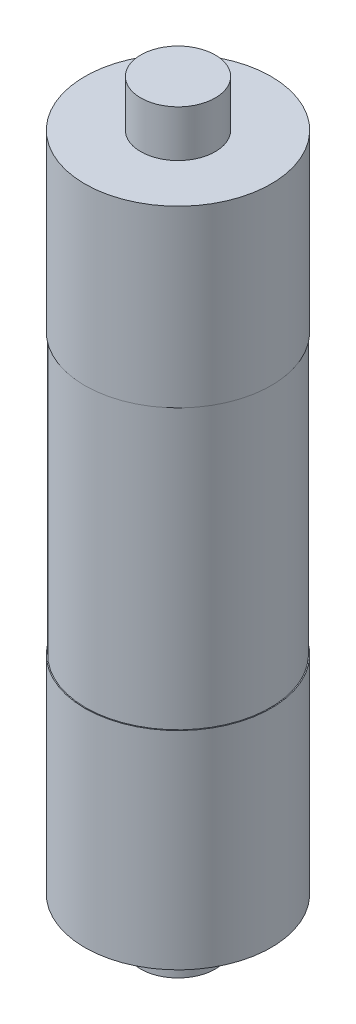
ISO-10303-21;
HEADER;
FILE_DESCRIPTION(('STEP AP214'),'2;1');
FILE_NAME('part.step','',(''),(''),'','','');
FILE_SCHEMA(('AUTOMOTIVE_DESIGN { 1 0 10303 214 1 1 1 1 }'));
ENDSEC;
DATA;
#1=APPLICATION_CONTEXT('core data for automotive mechanical design processes');
#2=APPLICATION_PROTOCOL_DEFINITION('international standard','automotive_design',2000,#1);
#3=PRODUCT_CONTEXT('',#1,'mechanical');
#4=PRODUCT('Part','Part','',(#3));
#5=PRODUCT_RELATED_PRODUCT_CATEGORY('part','',(#4));
#6=PRODUCT_DEFINITION_FORMATION('','',#4);
#7=PRODUCT_DEFINITION_CONTEXT('part definition',#1,'design');
#8=PRODUCT_DEFINITION('design','',#6,#7);
#9=PRODUCT_DEFINITION_SHAPE('','',#8);
#10=(LENGTH_UNIT() NAMED_UNIT(*) SI_UNIT(.MILLI.,.METRE.));
#11=(NAMED_UNIT(*) PLANE_ANGLE_UNIT() SI_UNIT($,.RADIAN.));
#12=(NAMED_UNIT(*) SI_UNIT($,.STERADIAN.) SOLID_ANGLE_UNIT());
#13=UNCERTAINTY_MEASURE_WITH_UNIT(LENGTH_MEASURE(1.E-05),#10,'distance_accuracy_value','');
#14=(GEOMETRIC_REPRESENTATION_CONTEXT(3) GLOBAL_UNCERTAINTY_ASSIGNED_CONTEXT((#13)) GLOBAL_UNIT_ASSIGNED_CONTEXT((#10,
#11,#12)) REPRESENTATION_CONTEXT('',''));
#15=CARTESIAN_POINT('',(0.,0.,0.));
#16=DIRECTION('',(0.,0.,1.));
#17=DIRECTION('',(1.,0.,0.));
#18=AXIS2_PLACEMENT_3D('',#15,#16,#17);
#19=CARTESIAN_POINT('',(0.,71.,0.));
#20=DIRECTION('',(0.,-1.,0.));
#21=DIRECTION('',(0.,0.,-1.));
#22=AXIS2_PLACEMENT_3D('',#19,#20,#21);
#23=CYLINDRICAL_SURFACE('',#22,10.);
#24=CARTESIAN_POINT('',(0.,71.,0.));
#25=DIRECTION('',(0.,1.,0.));
#26=DIRECTION('',(0.,0.,1.));
#27=AXIS2_PLACEMENT_3D('',#24,#25,#26);
#28=CIRCLE('',#27,10.);
#29=CARTESIAN_POINT('',(0.,71.,10.));
#30=VERTEX_POINT('',#29);
#31=EDGE_CURVE('E36',#30,#30,#28,.T.);
#32=ORIENTED_EDGE('',*,*,#31,.F.);
#33=EDGE_LOOP('',(#32));
#34=FACE_BOUND('',#33,.T.);
#35=CARTESIAN_POINT('',(0.,52.25,0.));
#36=DIRECTION('',(0.,1.,0.));
#37=DIRECTION('',(0.,0.,1.));
#38=AXIS2_PLACEMENT_3D('',#35,#36,#37);
#39=CIRCLE('',#38,9.99999999999998);
#40=CARTESIAN_POINT('',(0.,52.25,9.99999999999998));
#41=VERTEX_POINT('',#40);
#42=EDGE_CURVE('E45',#41,#41,#39,.T.);
#43=ORIENTED_EDGE('',*,*,#42,.T.);
#44=EDGE_LOOP('',(#43));
#45=FACE_BOUND('',#44,.T.);
#46=ADVANCED_FACE('F30',(#34,#45),#23,.T.);
#47=CARTESIAN_POINT('',(0.,71.,0.));
#48=DIRECTION('',(0.,1.,0.));
#49=DIRECTION('',(0.,0.,1.));
#50=AXIS2_PLACEMENT_3D('',#47,#48,#49);
#51=PLANE('',#50);
#52=CARTESIAN_POINT('',(0.,71.,0.));
#53=DIRECTION('',(0.,1.,0.));
#54=DIRECTION('',(0.,0.,1.));
#55=AXIS2_PLACEMENT_3D('',#52,#53,#54);
#56=CIRCLE('',#55,4.);
#57=CARTESIAN_POINT('',(0.,71.,4.));
#58=VERTEX_POINT('',#57);
#59=EDGE_CURVE('E62',#58,#58,#56,.T.);
#60=ORIENTED_EDGE('',*,*,#59,.F.);
#61=EDGE_LOOP('',(#60));
#62=FACE_BOUND('',#61,.T.);
#63=ORIENTED_EDGE('',*,*,#31,.T.);
#64=EDGE_LOOP('',(#63));
#65=FACE_BOUND('',#64,.T.);
#66=ADVANCED_FACE('F77',(#62,#65),#51,.T.);
#67=CARTESIAN_POINT('',(0.,52.25,-9.99999999999998));
#68=DIRECTION('',(0.,-1.,0.));
#69=DIRECTION('',(0.,0.,-1.));
#70=AXIS2_PLACEMENT_3D('',#67,#68,#69);
#71=PLANE('',#70);
#72=CARTESIAN_POINT('',(0.,52.25,0.));
#73=DIRECTION('',(0.,1.,0.));
#74=DIRECTION('',(0.,0.,1.));
#75=AXIS2_PLACEMENT_3D('',#72,#73,#74);
#76=CIRCLE('',#75,9.9);
#77=CARTESIAN_POINT('',(0.,52.25,9.9));
#78=VERTEX_POINT('',#77);
#79=EDGE_CURVE('E49',#78,#78,#76,.T.);
#80=ORIENTED_EDGE('',*,*,#79,.T.);
#81=EDGE_LOOP('',(#80));
#82=FACE_BOUND('',#81,.T.);
#83=ORIENTED_EDGE('',*,*,#42,.F.);
#84=EDGE_LOOP('',(#83));
#85=FACE_BOUND('',#84,.T.);
#86=ADVANCED_FACE('F79',(#82,#85),#71,.T.);
#87=CARTESIAN_POINT('',(0.,71.,0.));
#88=DIRECTION('',(0.,1.,0.));
#89=DIRECTION('',(0.,0.,1.));
#90=AXIS2_PLACEMENT_3D('',#87,#88,#89);
#91=CYLINDRICAL_SURFACE('',#90,9.9);
#92=CARTESIAN_POINT('',(0.,22.25,0.));
#93=DIRECTION('',(0.,1.,0.));
#94=DIRECTION('',(0.,0.,1.));
#95=AXIS2_PLACEMENT_3D('',#92,#93,#94);
#96=CIRCLE('',#95,9.9);
#97=CARTESIAN_POINT('',(0.,22.25,9.9));
#98=VERTEX_POINT('',#97);
#99=EDGE_CURVE('E52',#98,#98,#96,.T.);
#100=ORIENTED_EDGE('',*,*,#99,.T.);
#101=EDGE_LOOP('',(#100));
#102=FACE_BOUND('',#101,.T.);
#103=ORIENTED_EDGE('',*,*,#79,.F.);
#104=EDGE_LOOP('',(#103));
#105=FACE_BOUND('',#104,.T.);
#106=ADVANCED_FACE('F85',(#102,#105),#91,.T.);
#107=CARTESIAN_POINT('',(0.,22.25,-10.));
#108=DIRECTION('',(0.,1.,0.));
#109=DIRECTION('',(0.,0.,1.));
#110=AXIS2_PLACEMENT_3D('',#107,#108,#109);
#111=PLANE('',#110);
#112=CARTESIAN_POINT('',(0.,22.25,0.));
#113=DIRECTION('',(0.,1.,0.));
#114=DIRECTION('',(0.,0.,1.));
#115=AXIS2_PLACEMENT_3D('',#112,#113,#114);
#116=CIRCLE('',#115,10.);
#117=CARTESIAN_POINT('',(0.,22.25,10.));
#118=VERTEX_POINT('',#117);
#119=EDGE_CURVE('E55',#118,#118,#116,.T.);
#120=ORIENTED_EDGE('',*,*,#119,.T.);
#121=EDGE_LOOP('',(#120));
#122=FACE_BOUND('',#121,.T.);
#123=ORIENTED_EDGE('',*,*,#99,.F.);
#124=EDGE_LOOP('',(#123));
#125=FACE_BOUND('',#124,.T.);
#126=ADVANCED_FACE('F93',(#122,#125),#111,.T.);
#127=CARTESIAN_POINT('',(0.,0.,0.));
#128=DIRECTION('',(0.,1.,0.));
#129=DIRECTION('',(0.,0.,1.));
#130=AXIS2_PLACEMENT_3D('',#127,#128,#129);
#131=PLANE('',#130);
#132=CARTESIAN_POINT('',(0.,0.,0.));
#133=DIRECTION('',(0.,1.,0.));
#134=DIRECTION('',(0.,0.,1.));
#135=AXIS2_PLACEMENT_3D('',#132,#133,#134);
#136=CIRCLE('',#135,4.);
#137=CARTESIAN_POINT('',(0.,0.,4.));
#138=VERTEX_POINT('',#137);
#139=EDGE_CURVE('E10',#138,#138,#136,.F.);
#140=ORIENTED_EDGE('',*,*,#139,.F.);
#141=EDGE_LOOP('',(#140));
#142=FACE_BOUND('',#141,.T.);
#143=CARTESIAN_POINT('',(0.,0.,0.));
#144=DIRECTION('',(0.,1.,0.));
#145=DIRECTION('',(0.,0.,1.));
#146=AXIS2_PLACEMENT_3D('',#143,#144,#145);
#147=CIRCLE('',#146,10.);
#148=CARTESIAN_POINT('',(0.,0.,10.));
#149=VERTEX_POINT('',#148);
#150=EDGE_CURVE('E40',#149,#149,#147,.T.);
#151=ORIENTED_EDGE('',*,*,#150,.F.);
#152=EDGE_LOOP('',(#151));
#153=FACE_BOUND('',#152,.T.);
#154=ADVANCED_FACE('F91',(#142,#153),#131,.F.);
#155=ORIENTED_EDGE('',*,*,#150,.T.);
#156=EDGE_LOOP('',(#155));
#157=FACE_BOUND('',#156,.T.);
#158=ORIENTED_EDGE('',*,*,#119,.F.);
#159=EDGE_LOOP('',(#158));
#160=FACE_BOUND('',#159,.T.);
#161=ADVANCED_FACE('F89',(#157,#160),#23,.T.);
#162=CARTESIAN_POINT('',(0.,-5.,0.));
#163=DIRECTION('',(0.,1.,0.));
#164=DIRECTION('',(0.,0.,1.));
#165=AXIS2_PLACEMENT_3D('',#162,#163,#164);
#166=CYLINDRICAL_SURFACE('',#165,4.);
#167=CARTESIAN_POINT('',(0.,-5.,0.));
#168=DIRECTION('',(0.,-1.,0.));
#169=DIRECTION('',(0.,0.,-1.));
#170=AXIS2_PLACEMENT_3D('',#167,#168,#169);
#171=CIRCLE('',#170,4.);
#172=CARTESIAN_POINT('',(0.,-5.,-4.));
#173=VERTEX_POINT('',#172);
#174=EDGE_CURVE('E58',#173,#173,#171,.T.);
#175=ORIENTED_EDGE('',*,*,#174,.F.);
#176=EDGE_LOOP('',(#175));
#177=FACE_BOUND('',#176,.T.);
#178=ORIENTED_EDGE('',*,*,#139,.T.);
#179=EDGE_LOOP('',(#178));
#180=FACE_BOUND('',#179,.T.);
#181=ADVANCED_FACE('F99',(#177,#180),#166,.T.);
#182=CARTESIAN_POINT('',(0.,-5.,0.));
#183=DIRECTION('',(0.,-1.,0.));
#184=DIRECTION('',(0.,0.,-1.));
#185=AXIS2_PLACEMENT_3D('',#182,#183,#184);
#186=PLANE('',#185);
#187=ORIENTED_EDGE('',*,*,#174,.T.);
#188=EDGE_LOOP('',(#187));
#189=FACE_BOUND('',#188,.T.);
#190=ADVANCED_FACE('F73',(#189),#186,.T.);
#191=CARTESIAN_POINT('',(0.,76.,0.));
#192=DIRECTION('',(0.,-1.,0.));
#193=DIRECTION('',(0.,0.,-1.));
#194=AXIS2_PLACEMENT_3D('',#191,#192,#193);
#195=CYLINDRICAL_SURFACE('',#194,4.);
#196=CARTESIAN_POINT('',(0.,76.,0.));
#197=DIRECTION('',(0.,1.,0.));
#198=DIRECTION('',(0.,0.,1.));
#199=AXIS2_PLACEMENT_3D('',#196,#197,#198);
#200=CIRCLE('',#199,4.);
#201=CARTESIAN_POINT('',(0.,76.,4.));
#202=VERTEX_POINT('',#201);
#203=EDGE_CURVE('E61',#202,#202,#200,.T.);
#204=ORIENTED_EDGE('',*,*,#203,.F.);
#205=EDGE_LOOP('',(#204));
#206=FACE_BOUND('',#205,.T.);
#207=ORIENTED_EDGE('',*,*,#59,.T.);
#208=EDGE_LOOP('',(#207));
#209=FACE_BOUND('',#208,.T.);
#210=ADVANCED_FACE('F70',(#206,#209),#195,.T.);
#211=CARTESIAN_POINT('',(0.,76.,0.));
#212=DIRECTION('',(0.,1.,0.));
#213=DIRECTION('',(0.,0.,1.));
#214=AXIS2_PLACEMENT_3D('',#211,#212,#213);
#215=PLANE('',#214);
#216=ORIENTED_EDGE('',*,*,#203,.T.);
#217=EDGE_LOOP('',(#216));
#218=FACE_BOUND('',#217,.T.);
#219=ADVANCED_FACE('F68',(#218),#215,.T.);
#220=CLOSED_SHELL('',(#46,#66,#86,#106,#126,#154,#161,#181,#190,#210,#219));
#221=MANIFOLD_SOLID_BREP('B2',#220);
#222=ADVANCED_BREP_SHAPE_REPRESENTATION('',(#18,#221),#14);
#223=SHAPE_DEFINITION_REPRESENTATION(#9,#222);
ENDSEC;
END-ISO-10303-21;
